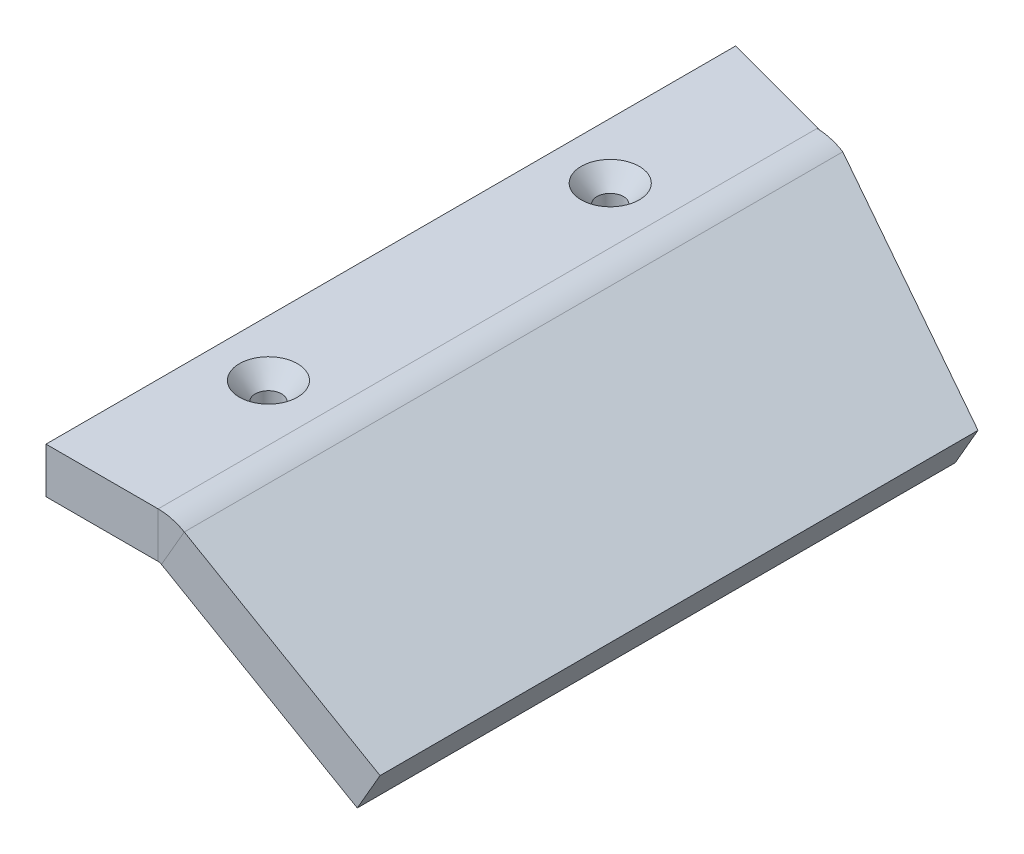
ISO-10303-21;
HEADER;
FILE_DESCRIPTION(('STEP AP214'),'2;1');
FILE_NAME('part.step','',(''),(''),'','','');
FILE_SCHEMA(('AUTOMOTIVE_DESIGN { 1 0 10303 214 1 1 1 1 }'));
ENDSEC;
DATA;
#1=APPLICATION_CONTEXT('core data for automotive mechanical design processes');
#2=APPLICATION_PROTOCOL_DEFINITION('international standard','automotive_design',2000,#1);
#3=PRODUCT_CONTEXT('',#1,'mechanical');
#4=PRODUCT('Part','Part','',(#3));
#5=PRODUCT_RELATED_PRODUCT_CATEGORY('part','',(#4));
#6=PRODUCT_DEFINITION_FORMATION('','',#4);
#7=PRODUCT_DEFINITION_CONTEXT('part definition',#1,'design');
#8=PRODUCT_DEFINITION('design','',#6,#7);
#9=PRODUCT_DEFINITION_SHAPE('','',#8);
#10=(LENGTH_UNIT() NAMED_UNIT(*) SI_UNIT(.MILLI.,.METRE.));
#11=(NAMED_UNIT(*) PLANE_ANGLE_UNIT() SI_UNIT($,.RADIAN.));
#12=(NAMED_UNIT(*) SI_UNIT($,.STERADIAN.) SOLID_ANGLE_UNIT());
#13=UNCERTAINTY_MEASURE_WITH_UNIT(LENGTH_MEASURE(1.E-05),#10,'distance_accuracy_value','');
#14=(GEOMETRIC_REPRESENTATION_CONTEXT(3) GLOBAL_UNCERTAINTY_ASSIGNED_CONTEXT((#13)) GLOBAL_UNIT_ASSIGNED_CONTEXT((#10,
#11,#12)) REPRESENTATION_CONTEXT('',''));
#15=CARTESIAN_POINT('',(0.,0.,0.));
#16=DIRECTION('',(0.,0.,1.));
#17=DIRECTION('',(1.,0.,0.));
#18=AXIS2_PLACEMENT_3D('',#15,#16,#17);
#19=CARTESIAN_POINT('',(0.,-5.08,38.4302));
#20=DIRECTION('',(0.,0.,1.));
#21=DIRECTION('',(1.,0.,0.));
#22=AXIS2_PLACEMENT_3D('',#19,#20,#21);
#23=PLANE('',#22);
#24=DIRECTION('',(1.,0.,0.));
#25=VECTOR('',#24,1.);
#26=CARTESIAN_POINT('',(0.,-5.08,38.4302));
#27=LINE('',#26,#25);
#28=CARTESIAN_POINT('',(0.,-5.08,38.4302));
#29=VERTEX_POINT('',#28);
#30=CARTESIAN_POINT('',(12.5026286248552,-5.08,38.4302));
#31=VERTEX_POINT('',#30);
#32=EDGE_CURVE('E100',#29,#31,#27,.T.);
#33=ORIENTED_EDGE('',*,*,#32,.T.);
#34=DIRECTION('',(0.,1.,0.));
#35=VECTOR('',#34,1.);
#36=CARTESIAN_POINT('',(12.5026286248552,-5.08,38.4302));
#37=LINE('',#36,#35);
#38=CARTESIAN_POINT('',(12.5026286248553,0.,38.4302));
#39=VERTEX_POINT('',#38);
#40=EDGE_CURVE('E222',#31,#39,#37,.T.);
#41=ORIENTED_EDGE('',*,*,#40,.T.);
#42=DIRECTION('',(1.,0.,0.));
#43=VECTOR('',#42,1.);
#44=CARTESIAN_POINT('',(0.,0.,38.4302));
#45=LINE('',#44,#43);
#46=CARTESIAN_POINT('',(0.,0.,38.4302));
#47=VERTEX_POINT('',#46);
#48=EDGE_CURVE('E93',#47,#39,#45,.T.);
#49=ORIENTED_EDGE('',*,*,#48,.F.);
#50=DIRECTION('',(0.,1.,0.));
#51=VECTOR('',#50,1.);
#52=CARTESIAN_POINT('',(0.,-5.08,38.4302));
#53=LINE('',#52,#51);
#54=EDGE_CURVE('E89',#29,#47,#53,.T.);
#55=ORIENTED_EDGE('',*,*,#54,.F.);
#56=EDGE_LOOP('',(#33,#41,#49,#55));
#57=FACE_BOUND('',#56,.T.);
#58=ADVANCED_FACE('F44',(#57),#23,.T.);
#59=CARTESIAN_POINT('',(0.,-5.08,0.));
#60=DIRECTION('',(0.,1.,0.));
#61=DIRECTION('',(0.,0.,1.));
#62=AXIS2_PLACEMENT_3D('',#59,#60,#61);
#63=PLANE('',#62);
#64=CARTESIAN_POINT('',(6.25131431242764,-5.08,-18.2124826891759));
#65=DIRECTION('',(0.,1.,0.));
#66=DIRECTION('',(0.,0.,1.));
#67=AXIS2_PLACEMENT_3D('',#64,#65,#66);
#68=CIRCLE('',#67,1.47319999999999);
#69=CARTESIAN_POINT('',(6.25131431242764,-5.08,-16.739282689176));
#70=VERTEX_POINT('',#69);
#71=EDGE_CURVE('E48',#70,#70,#68,.T.);
#72=ORIENTED_EDGE('',*,*,#71,.T.);
#73=EDGE_LOOP('',(#72));
#74=FACE_BOUND('',#73,.T.);
#75=CARTESIAN_POINT('',(6.25131431242764,-5.08,19.8875173108241));
#76=DIRECTION('',(0.,1.,0.));
#77=DIRECTION('',(0.,0.,1.));
#78=AXIS2_PLACEMENT_3D('',#75,#76,#77);
#79=CIRCLE('',#78,1.47319999999999);
#80=CARTESIAN_POINT('',(6.25131431242764,-5.08,21.360717310824));
#81=VERTEX_POINT('',#80);
#82=EDGE_CURVE('E105',#81,#81,#79,.T.);
#83=ORIENTED_EDGE('',*,*,#82,.T.);
#84=EDGE_LOOP('',(#83));
#85=FACE_BOUND('',#84,.T.);
#86=DIRECTION('',(0.,0.,1.));
#87=VECTOR('',#86,1.);
#88=CARTESIAN_POINT('',(12.5026286248552,-5.08,38.4302));
#89=LINE('',#88,#87);
#90=CARTESIAN_POINT('',(12.5026286248552,-5.08,-35.0272452561247));
#91=VERTEX_POINT('',#90);
#92=EDGE_CURVE('E163',#31,#91,#89,.F.);
#93=ORIENTED_EDGE('',*,*,#92,.F.);
#94=ORIENTED_EDGE('',*,*,#32,.F.);
#95=DIRECTION('',(0.,0.,1.));
#96=VECTOR('',#95,1.);
#97=CARTESIAN_POINT('',(0.,-5.08,-38.4302));
#98=LINE('',#97,#96);
#99=CARTESIAN_POINT('',(0.,-5.08,-38.4302));
#100=VERTEX_POINT('',#99);
#101=EDGE_CURVE('E98',#100,#29,#98,.T.);
#102=ORIENTED_EDGE('',*,*,#101,.F.);
#103=DIRECTION('',(-0.965925826289068,0.,-0.258819045102522));
#104=VECTOR('',#103,1.);
#105=CARTESIAN_POINT('',(0.,-5.08,-38.4302));
#106=LINE('',#105,#104);
#107=CARTESIAN_POINT('',(12.7,-5.08,-35.0272452561247));
#108=VERTEX_POINT('',#107);
#109=EDGE_CURVE('E85',#108,#100,#106,.T.);
#110=ORIENTED_EDGE('',*,*,#109,.F.);
#111=DIRECTION('',(1.,0.,0.));
#112=VECTOR('',#111,1.);
#113=CARTESIAN_POINT('',(12.5026286248552,-5.08,-35.0272452561247));
#114=LINE('',#113,#112);
#115=EDGE_CURVE('E94',#91,#108,#114,.T.);
#116=ORIENTED_EDGE('',*,*,#115,.F.);
#117=EDGE_LOOP('',(#93,#94,#102,#110,#116));
#118=FACE_BOUND('',#117,.T.);
#119=ADVANCED_FACE('F204',(#74,#85,#118),#63,.F.);
#120=CARTESIAN_POINT('',(0.,0.,0.));
#121=DIRECTION('',(0.,1.,0.));
#122=DIRECTION('',(0.,0.,1.));
#123=AXIS2_PLACEMENT_3D('',#120,#121,#122);
#124=PLANE('',#123);
#125=CARTESIAN_POINT('',(6.25131431242764,0.,-18.2124826891759));
#126=DIRECTION('',(0.,1.,0.));
#127=DIRECTION('',(0.,0.,1.));
#128=AXIS2_PLACEMENT_3D('',#125,#126,#127);
#129=CIRCLE('',#128,3.2385);
#130=CARTESIAN_POINT('',(6.25131431242764,0.,-14.9739826891759));
#131=VERTEX_POINT('',#130);
#132=EDGE_CURVE('E387',#131,#131,#129,.T.);
#133=ORIENTED_EDGE('',*,*,#132,.F.);
#134=EDGE_LOOP('',(#133));
#135=FACE_BOUND('',#134,.T.);
#136=CARTESIAN_POINT('',(6.25131431242764,0.,19.8875173108241));
#137=DIRECTION('',(0.,1.,0.));
#138=DIRECTION('',(0.,0.,1.));
#139=AXIS2_PLACEMENT_3D('',#136,#137,#138);
#140=CIRCLE('',#139,3.2385);
#141=CARTESIAN_POINT('',(6.25131431242764,0.,23.1260173108241));
#142=VERTEX_POINT('',#141);
#143=EDGE_CURVE('E115',#142,#142,#140,.T.);
#144=ORIENTED_EDGE('',*,*,#143,.F.);
#145=EDGE_LOOP('',(#144));
#146=FACE_BOUND('',#145,.T.);
#147=ORIENTED_EDGE('',*,*,#48,.T.);
#148=DIRECTION('',(0.,0.,1.));
#149=VECTOR('',#148,1.);
#150=CARTESIAN_POINT('',(12.5026286248553,0.,38.4302));
#151=LINE('',#150,#149);
#152=CARTESIAN_POINT('',(12.5026286248552,0.,-35.0272452561247));
#153=VERTEX_POINT('',#152);
#154=EDGE_CURVE('E159',#39,#153,#151,.F.);
#155=ORIENTED_EDGE('',*,*,#154,.T.);
#156=DIRECTION('',(1.,0.,0.));
#157=VECTOR('',#156,1.);
#158=CARTESIAN_POINT('',(0.,0.,-35.0272452561247));
#159=LINE('',#158,#157);
#160=CARTESIAN_POINT('',(12.7,0.,-35.0272452561247));
#161=VERTEX_POINT('',#160);
#162=EDGE_CURVE('E11',#153,#161,#159,.T.);
#163=ORIENTED_EDGE('',*,*,#162,.T.);
#164=DIRECTION('',(-0.965925826289068,0.,-0.258819045102522));
#165=VECTOR('',#164,1.);
#166=CARTESIAN_POINT('',(0.,0.,-38.4302));
#167=LINE('',#166,#165);
#168=CARTESIAN_POINT('',(0.,0.,-38.4302));
#169=VERTEX_POINT('',#168);
#170=EDGE_CURVE('E83',#161,#169,#167,.T.);
#171=ORIENTED_EDGE('',*,*,#170,.T.);
#172=DIRECTION('',(0.,0.,1.));
#173=VECTOR('',#172,1.);
#174=CARTESIAN_POINT('',(0.,0.,-38.4302));
#175=LINE('',#174,#173);
#176=EDGE_CURVE('E88',#169,#47,#175,.T.);
#177=ORIENTED_EDGE('',*,*,#176,.T.);
#178=EDGE_LOOP('',(#147,#155,#163,#171,#177));
#179=FACE_BOUND('',#178,.T.);
#180=ADVANCED_FACE('F96',(#135,#146,#179),#124,.T.);
#181=CARTESIAN_POINT('',(0.,-5.08,-38.4302));
#182=DIRECTION('',(-1.,0.,0.));
#183=DIRECTION('',(0.,0.,1.));
#184=AXIS2_PLACEMENT_3D('',#181,#182,#183);
#185=PLANE('',#184);
#186=ORIENTED_EDGE('',*,*,#176,.F.);
#187=DIRECTION('',(0.,1.,0.));
#188=VECTOR('',#187,1.);
#189=CARTESIAN_POINT('',(0.,-5.08,-38.4302));
#190=LINE('',#189,#188);
#191=EDGE_CURVE('E54',#100,#169,#190,.T.);
#192=ORIENTED_EDGE('',*,*,#191,.F.);
#193=ORIENTED_EDGE('',*,*,#101,.T.);
#194=ORIENTED_EDGE('',*,*,#54,.T.);
#195=EDGE_LOOP('',(#186,#192,#193,#194));
#196=FACE_BOUND('',#195,.T.);
#197=ADVANCED_FACE('F46',(#196),#185,.T.);
#198=CARTESIAN_POINT('',(0.,-5.08,-38.4302));
#199=DIRECTION('',(0.258819045102521,0.,-0.965925826289068));
#200=DIRECTION('',(-0.965925826289068,0.,-0.258819045102522));
#201=AXIS2_PLACEMENT_3D('',#198,#199,#200);
#202=PLANE('',#201);
#203=ORIENTED_EDGE('',*,*,#170,.F.);
#204=DIRECTION('',(0.,1.,0.));
#205=VECTOR('',#204,1.);
#206=CARTESIAN_POINT('',(12.7,-5.08,-35.0272452561247));
#207=LINE('',#206,#205);
#208=EDGE_CURVE('E77',#108,#161,#207,.T.);
#209=ORIENTED_EDGE('',*,*,#208,.F.);
#210=ORIENTED_EDGE('',*,*,#109,.T.);
#211=ORIENTED_EDGE('',*,*,#191,.T.);
#212=EDGE_LOOP('',(#203,#209,#210,#211));
#213=FACE_BOUND('',#212,.T.);
#214=ADVANCED_FACE('F81',(#213),#202,.T.);
#215=CARTESIAN_POINT('',(12.5026286248552,-5.08,-35.0272452561247));
#216=DIRECTION('',(0.,0.,1.));
#217=DIRECTION('',(0.,-1.,0.));
#218=AXIS2_PLACEMENT_3D('',#215,#216,#217);
#219=PLANE('',#218);
#220=ORIENTED_EDGE('',*,*,#162,.F.);
#221=DIRECTION('',(0.,1.,0.));
#222=VECTOR('',#221,1.);
#223=CARTESIAN_POINT('',(12.5026286248552,-5.08,-35.0272452561247));
#224=LINE('',#223,#222);
#225=EDGE_CURVE('E232',#91,#153,#224,.T.);
#226=ORIENTED_EDGE('',*,*,#225,.F.);
#227=ORIENTED_EDGE('',*,*,#115,.T.);
#228=ORIENTED_EDGE('',*,*,#208,.T.);
#229=EDGE_LOOP('',(#220,#226,#227,#228));
#230=FACE_BOUND('',#229,.T.);
#231=ADVANCED_FACE('F192',(#230),#219,.T.);
#232=CARTESIAN_POINT('',(12.5026286248552,0.0507999999999983,-35.0272452561247));
#233=CARTESIAN_POINT('',(13.5283405845327,0.0508000000000031,-35.0095882202342));
#234=CARTESIAN_POINT('',(14.548036010809,-0.222426565996431,-34.9920167914362));
#235=CARTESIAN_POINT('',(15.4363286248552,-0.735282545835161,-34.9743597555457));
#236=CARTESIAN_POINT('',(12.5026286248552,0.,-35.0272452561247));
#237=CARTESIAN_POINT('',(13.5194599346864,0.,-35.0095882239438));
#238=CARTESIAN_POINT('',(14.5303268791779,-0.270860981431803,-34.9920167877266));
#239=CARTESIAN_POINT('',(15.4109286248552,-0.779276636347411,-34.9743597555457));
#240=CARTESIAN_POINT('',(12.5026286248552,-5.08,-35.0272452561247));
#241=CARTESIAN_POINT('',(12.631394950062,-5.08,-35.0095885948986));
#242=CARTESIAN_POINT('',(12.7594137160742,-5.11430252496899,-34.9920164167718));
#243=CARTESIAN_POINT('',(12.8709286248552,-5.17868568757238,-34.9743597555457));
#244=B_SPLINE_SURFACE_WITH_KNOTS('',1,3,((#232,#233,#234,#235),(#236,#237,#238,#239),(#240,#241,
#242,#243)),.UNSPECIFIED.,.F.,.F.,.F.,(2,1,2),(4,4),(-0.01,0.,1.),(0.,1.),.UNSPECIFIED.);
#245=DIRECTION('',(0.499999999999995,0.866025403784442,0.));
#246=VECTOR('',#245,1.);
#247=CARTESIAN_POINT('',(12.8709286248552,-5.17868568757238,-34.9743597555457));
#248=LINE('',#247,#246);
#249=CARTESIAN_POINT('',(12.8709286248552,-5.17868568757238,-34.9743597555457));
#250=VERTEX_POINT('',#249);
#251=CARTESIAN_POINT('',(15.4109286248552,-0.779276636347418,-34.9743597555457));
#252=VERTEX_POINT('',#251);
#253=EDGE_CURVE('E107',#250,#252,#248,.T.);
#254=CARTESIAN_POINT('',(12.5026286248552,-5.08,-35.0272452561247));
#255=CARTESIAN_POINT('',(12.5106636860023,-5.07999994946432,-35.0261434748627));
#256=CARTESIAN_POINT('',(12.5186987442839,-5.0801314715469,-35.0250416936006));
#257=CARTESIAN_POINT('',(12.5347602582397,-5.08065729818292,-35.0228381310765));
#258=CARTESIAN_POINT('',(12.5427867139139,-5.08105160273637,-35.0217363498144));
#259=CARTESIAN_POINT('',(12.5588224257784,-5.08210263154852,-35.0195327872903));
#260=CARTESIAN_POINT('',(12.5668316819688,-5.08275935580721,-35.0184310060282));
#261=CARTESIAN_POINT('',(12.5828244188752,-5.08433450485931,-35.0162274435041));
#262=CARTESIAN_POINT('',(12.5908078995912,-5.08525292965271,-35.015125662242));
#263=CARTESIAN_POINT('',(12.6067405364979,-5.0873505005714,-35.0129220997179));
#264=CARTESIAN_POINT('',(12.6146896926886,-5.08852964669669,-35.0118203184558));
#265=CARTESIAN_POINT('',(12.6305451684268,-5.09114739647587,-35.0096167559317));
#266=CARTESIAN_POINT('',(12.6384514879742,-5.09258600012976,-35.0085149746697));
#267=CARTESIAN_POINT('',(12.6542128241305,-5.09572112478021,-35.0063114121455));
#268=CARTESIAN_POINT('',(12.6620678407393,-5.09741764577677,-35.0052096308834));
#269=CARTESIAN_POINT('',(12.6777181596734,-5.10106678835187,-35.0030060683593));
#270=CARTESIAN_POINT('',(12.6855134619986,-5.1030194099304,-35.0019042870973));
#271=CARTESIAN_POINT('',(12.7010360049569,-5.10717866278055,-34.9997007245731));
#272=CARTESIAN_POINT('',(12.70876324559,-5.10938529405217,-34.9985989433111));
#273=CARTESIAN_POINT('',(12.7241413906518,-5.11405020334714,-34.9963953807869));
#274=CARTESIAN_POINT('',(12.7317922950805,-5.1165084813705,-34.9952935995249));
#275=CARTESIAN_POINT('',(12.7470095749146,-5.12167405185731,-34.9930900370007));
#276=CARTESIAN_POINT('',(12.7545759503201,-5.12438134432078,-34.9919882557387));
#277=CARTESIAN_POINT('',(12.769616069988,-5.13004204438033,-34.9897846932146));
#278=CARTESIAN_POINT('',(12.7770898142504,-5.13299545197642,-34.9886829119525));
#279=CARTESIAN_POINT('',(12.7919366680203,-5.13914522072795,-34.9864793494284));
#280=CARTESIAN_POINT('',(12.7993097775277,-5.1423415818834,-34.9853775681663));
#281=CARTESIAN_POINT('',(12.8139474684906,-5.14897383124272,-34.9831740056422));
#282=CARTESIAN_POINT('',(12.8212120499463,-5.15240971944659,-34.9820722243801));
#283=CARTESIAN_POINT('',(12.8356248981948,-5.15951735772745,-34.979868661856));
#284=CARTESIAN_POINT('',(12.8427731649878,-5.16318910780444,-34.9787668805939));
#285=CARTESIAN_POINT('',(12.8569457574148,-5.17076448555756,-34.9765633180698));
#286=CARTESIAN_POINT('',(12.8639700830488,-5.17466811323368,-34.9754615368077));
#287=CARTESIAN_POINT('',(12.8709286248552,-5.17868568757238,-34.9743597555457));
#288=B_SPLINE_CURVE_WITH_KNOTS('',3,(#254,#255,#256,#257,#258,#259,#260,#261,#262,#263,#264,
#265,#266,#267,#268,#269,#270,#271,#272,#273,#274,#275,#276,#277,#278,#279,#280,#281,#282,#283,
#284,#285,#286,#287),.UNSPECIFIED.,.F.,.F.,(4,2,2,2,2,2,2,2,2,2,2,2,2,2,2,2,4),(0.,
0.0243296748956679,0.0486593497913393,0.0729890246870078,0.0973186995826769,0.121648374478346,
0.145978049374014,0.170307724269684,0.194637399165352,0.218967074061022,0.24329674895669,
0.267626423852359,0.291956098748027,0.316285773643696,0.340615448539366,0.364945123435034,
0.389274798330704),.UNSPECIFIED.);
#289=EDGE_CURVE('E160',#91,#250,#288,.T.);
#290=CARTESIAN_POINT('',(12.5026286248552,0.,-35.0272452561247));
#291=CARTESIAN_POINT('',(12.5660779008094,3.99057596044768E-07,-35.0261434748627));
#292=CARTESIAN_POINT('',(12.6295271541364,-0.00103817187032179,-35.0250416936006));
#293=CARTESIAN_POINT('',(12.7563577298563,-0.00519038909962282,-35.0228381310765));
#294=CARTESIAN_POINT('',(12.8197390522493,-0.00830403540100605,-35.0217363498144));
#295=CARTESIAN_POINT('',(12.9463658804213,-0.016603538779672,-35.0195327872903));
#296=CARTESIAN_POINT('',(13.0096113862003,-0.0217893958569547,-35.0184310060282));
#297=CARTESIAN_POINT('',(13.1358988603919,-0.0342276418200424,-35.0162274435041));
#298=CARTESIAN_POINT('',(13.1989408288044,-0.0414800307058473,-35.015125662242));
#299=CARTESIAN_POINT('',(13.3247537202403,-0.0580436079603358,-35.0129220997179));
#300=CARTESIAN_POINT('',(13.3875246432636,-0.0673547963290195,-35.0118203184558));
#301=CARTESIAN_POINT('',(13.5127282275407,-0.0880259928611592,-35.0096167559317));
#302=CARTESIAN_POINT('',(13.5751608887944,-0.0993860010246152,-35.0085149746697));
#303=CARTESIAN_POINT('',(13.699621094994,-0.124142674988515,-35.0063114121455));
#304=CARTESIAN_POINT('',(13.7616486399398,-0.137539340788958,-35.0052096308834));
#305=CARTESIAN_POINT('',(13.885232192902,-0.166354983881951,-35.0030060683593));
#306=CARTESIAN_POINT('',(13.9467882009184,-0.181773961174501,-35.0019042870973));
#307=CARTESIAN_POINT('',(14.0693627642787,-0.214617716439495,-34.9997007245731));
#308=CARTESIAN_POINT('',(14.1303813196227,-0.232042494411938,-34.9985989433111));
#309=CARTESIAN_POINT('',(14.2518156375244,-0.26887919194811,-34.9963953807869));
#310=CARTESIAN_POINT('',(14.3122314000821,-0.288291111511837,-34.9952935995249));
#311=CARTESIAN_POINT('',(14.4323954373931,-0.329081306045675,-34.9930900370007));
#312=CARTESIAN_POINT('',(14.4921437121464,-0.350459581015785,-34.9919882557387));
#313=CARTESIAN_POINT('',(14.6109087950413,-0.395159591830866,-34.9897846932146));
#314=CARTESIAN_POINT('',(14.6699256031828,-0.418481327675838,-34.9886829119525));
#315=CARTESIAN_POINT('',(14.7871645519171,-0.467043294713831,-34.9864793494284));
#316=CARTESIAN_POINT('',(14.8453866925098,-0.492283525906853,-34.9853775681663));
#317=CARTESIAN_POINT('',(14.9609739763211,-0.54465542602009,-34.9831740056422));
#318=CARTESIAN_POINT('',(15.0183391195396,-0.571787094940304,-34.9820722243801));
#319=CARTESIAN_POINT('',(15.1321509212265,-0.627912928261587,-34.979868661856));
#320=CARTESIAN_POINT('',(15.1885975796949,-0.656907092662655,-34.9787668805939));
#321=CARTESIAN_POINT('',(15.3005121888597,-0.716726454920019,-34.9765633180698));
#322=CARTESIAN_POINT('',(15.355980139556,-0.747551652776314,-34.9754615368077));
#323=CARTESIAN_POINT('',(15.4109286248552,-0.77927663634741,-34.9743597555457));
#324=B_SPLINE_CURVE_WITH_KNOTS('',3,(#290,#291,#292,#293,#294,#295,#296,#297,#298,#299,#300,
#301,#302,#303,#304,#305,#306,#307,#308,#309,#310,#311,#312,#313,#314,#315,#316,#317,#318,#319,
#320,#321,#322,#323),.UNSPECIFIED.,.F.,.F.,(4,2,2,2,2,2,2,2,2,2,2,2,2,2,2,2,4),(0.,
0.190367993726139,0.380735987452281,0.571103981178422,0.761471974904561,0.951839968630701,
1.14220796235684,1.33257595608298,1.52294394980912,1.71331194353526,1.90367993726141,
2.09404793098755,2.28441592471369,2.47478391843983,2.66515191216597,2.85551990589211,
3.04588789961825),.UNSPECIFIED.);
#325=EDGE_CURVE('E235',#153,#252,#324,.T.);
#326=ORIENTED_EDGE('',*,*,#253,.F.);
#327=ORIENTED_EDGE('',*,*,#289,.F.);
#328=ORIENTED_EDGE('',*,*,#225,.T.);
#329=ORIENTED_EDGE('',*,*,#325,.T.);
#330=EDGE_LOOP('',(#326,#327,#328,#329));
#331=FACE_BOUND('',#330,.T.);
#332=ADVANCED_FACE('F186',(#331),#244,.F.);
#333=CARTESIAN_POINT('',(12.5026286248552,-5.8166,38.4302));
#334=DIRECTION('',(0.,0.,-1.));
#335=DIRECTION('',(-1.,0.,0.));
#336=AXIS2_PLACEMENT_3D('',#333,#334,#335);
#337=PLANE('',#336);
#338=CARTESIAN_POINT('',(12.5026286248552,-5.8166,38.4302));
#339=DIRECTION('',(0.,0.,1.));
#340=DIRECTION('',(1.,0.,0.));
#341=AXIS2_PLACEMENT_3D('',#338,#339,#340);
#342=CIRCLE('',#341,0.736600000000001);
#343=CARTESIAN_POINT('',(12.8709286248552,-5.17868568757238,38.4302));
#344=VERTEX_POINT('',#343);
#345=EDGE_CURVE('E153',#344,#31,#342,.T.);
#346=ORIENTED_EDGE('',*,*,#345,.F.);
#347=DIRECTION('',(0.499999999999995,0.866025403784442,0.));
#348=VECTOR('',#347,1.);
#349=CARTESIAN_POINT('',(12.8709286248552,-5.17868568757238,38.4302));
#350=LINE('',#349,#348);
#351=CARTESIAN_POINT('',(15.4109286248552,-0.779276636347415,38.4302));
#352=VERTEX_POINT('',#351);
#353=EDGE_CURVE('E125',#344,#352,#350,.T.);
#354=ORIENTED_EDGE('',*,*,#353,.T.);
#355=CARTESIAN_POINT('',(12.5026286248552,-5.8166,38.4302));
#356=DIRECTION('',(0.,0.,1.));
#357=DIRECTION('',(1.,0.,0.));
#358=AXIS2_PLACEMENT_3D('',#355,#356,#357);
#359=CIRCLE('',#358,5.8166);
#360=EDGE_CURVE('E156',#352,#39,#359,.T.);
#361=ORIENTED_EDGE('',*,*,#360,.T.);
#362=ORIENTED_EDGE('',*,*,#40,.F.);
#363=EDGE_LOOP('',(#346,#354,#361,#362));
#364=FACE_BOUND('',#363,.T.);
#365=ADVANCED_FACE('F191',(#364),#337,.F.);
#366=CARTESIAN_POINT('',(12.5026286248552,-5.8166,38.4302));
#367=DIRECTION('',(0.,0.,1.));
#368=DIRECTION('',(0.499999999999995,0.866025403784441,0.));
#369=AXIS2_PLACEMENT_3D('',#366,#367,#368);
#370=CYLINDRICAL_SURFACE('',#369,5.8166);
#371=ORIENTED_EDGE('',*,*,#154,.F.);
#372=ORIENTED_EDGE('',*,*,#360,.F.);
#373=DIRECTION('',(0.,0.,1.));
#374=VECTOR('',#373,1.);
#375=CARTESIAN_POINT('',(15.4109286248552,-0.779276636347416,0.));
#376=LINE('',#375,#374);
#377=EDGE_CURVE('E127',#252,#352,#376,.T.);
#378=ORIENTED_EDGE('',*,*,#377,.F.);
#379=ORIENTED_EDGE('',*,*,#325,.F.);
#380=EDGE_LOOP('',(#371,#372,#378,#379));
#381=FACE_BOUND('',#380,.T.);
#382=ADVANCED_FACE('F182',(#381),#370,.T.);
#383=CARTESIAN_POINT('',(12.5026286248552,-5.8166,38.4302));
#384=DIRECTION('',(0.,0.,1.));
#385=DIRECTION('',(0.499999999999995,0.866025403784441,0.));
#386=AXIS2_PLACEMENT_3D('',#383,#384,#385);
#387=CYLINDRICAL_SURFACE('',#386,0.736600000000001);
#388=ORIENTED_EDGE('',*,*,#92,.T.);
#389=ORIENTED_EDGE('',*,*,#289,.T.);
#390=DIRECTION('',(0.,0.,1.));
#391=VECTOR('',#390,1.);
#392=CARTESIAN_POINT('',(12.8709286248552,-5.17868568757238,-34.9743597555457));
#393=LINE('',#392,#391);
#394=EDGE_CURVE('E112',#250,#344,#393,.T.);
#395=ORIENTED_EDGE('',*,*,#394,.T.);
#396=ORIENTED_EDGE('',*,*,#345,.T.);
#397=EDGE_LOOP('',(#388,#389,#395,#396));
#398=FACE_BOUND('',#397,.T.);
#399=ADVANCED_FACE('F171',(#398),#387,.F.);
#400=CARTESIAN_POINT('',(15.24,-0.680590948775038,38.4302));
#401=DIRECTION('',(0.,0.,1.));
#402=DIRECTION('',(0.,-1.,0.));
#403=AXIS2_PLACEMENT_3D('',#400,#401,#402);
#404=PLANE('',#403);
#405=DIRECTION('',(-0.866025403784441,0.499999999999995,0.));
#406=VECTOR('',#405,1.);
#407=CARTESIAN_POINT('',(15.24,-0.680590948775038,38.4302));
#408=LINE('',#407,#406);
#409=CARTESIAN_POINT('',(37.2370452561248,-13.3805909487749,38.4302));
#410=VERTEX_POINT('',#409);
#411=EDGE_CURVE('E139',#410,#352,#408,.T.);
#412=ORIENTED_EDGE('',*,*,#411,.T.);
#413=ORIENTED_EDGE('',*,*,#353,.F.);
#414=DIRECTION('',(-0.866025403784441,0.499999999999995,0.));
#415=VECTOR('',#414,1.);
#416=CARTESIAN_POINT('',(12.7,-5.08,38.4302));
#417=LINE('',#416,#415);
#418=CARTESIAN_POINT('',(34.6970452561248,-17.7799999999999,38.4302));
#419=VERTEX_POINT('',#418);
#420=EDGE_CURVE('E136',#419,#344,#417,.T.);
#421=ORIENTED_EDGE('',*,*,#420,.F.);
#422=DIRECTION('',(-0.499999999999995,-0.866025403784441,0.));
#423=VECTOR('',#422,1.);
#424=CARTESIAN_POINT('',(37.2370452561248,-13.3805909487749,38.4302));
#425=LINE('',#424,#423);
#426=EDGE_CURVE('E150',#410,#419,#425,.T.);
#427=ORIENTED_EDGE('',*,*,#426,.F.);
#428=EDGE_LOOP('',(#412,#413,#421,#427));
#429=FACE_BOUND('',#428,.T.);
#430=ADVANCED_FACE('F181',(#429),#404,.T.);
#431=CARTESIAN_POINT('',(15.24,-0.680590948775038,-35.0272452561247));
#432=DIRECTION('',(0.224143868042015,-0.129409522551259,-0.965925826289068));
#433=DIRECTION('',(-0.974116947696297,0.,-0.226044624379457));
#434=AXIS2_PLACEMENT_3D('',#431,#432,#433);
#435=PLANE('',#434);
#436=DIRECTION('',(0.836516303737811,-0.482962913144529,0.258819045102521));
#437=VECTOR('',#436,1.);
#438=CARTESIAN_POINT('',(12.7,-5.08,-35.0272452561247));
#439=LINE('',#438,#437);
#440=CARTESIAN_POINT('',(34.6970452561248,-17.7799999999999,-28.2213357683742));
#441=VERTEX_POINT('',#440);
#442=EDGE_CURVE('E131',#250,#441,#439,.T.);
#443=ORIENTED_EDGE('',*,*,#442,.F.);
#444=ORIENTED_EDGE('',*,*,#253,.T.);
#445=DIRECTION('',(0.836516303737811,-0.482962913144529,0.258819045102521));
#446=VECTOR('',#445,1.);
#447=CARTESIAN_POINT('',(15.24,-0.680590948775038,-35.0272452561247));
#448=LINE('',#447,#446);
#449=CARTESIAN_POINT('',(37.2370452561248,-13.3805909487749,-28.2213357683742));
#450=VERTEX_POINT('',#449);
#451=EDGE_CURVE('E132',#252,#450,#448,.T.);
#452=ORIENTED_EDGE('',*,*,#451,.T.);
#453=DIRECTION('',(-0.499999999999995,-0.866025403784441,0.));
#454=VECTOR('',#453,1.);
#455=CARTESIAN_POINT('',(37.2370452561248,-13.3805909487749,-28.2213357683742));
#456=LINE('',#455,#454);
#457=EDGE_CURVE('E142',#450,#441,#456,.T.);
#458=ORIENTED_EDGE('',*,*,#457,.T.);
#459=EDGE_LOOP('',(#443,#444,#452,#458));
#460=FACE_BOUND('',#459,.T.);
#461=ADVANCED_FACE('F288',(#460),#435,.T.);
#462=CARTESIAN_POINT('',(3.51529547438745,6.08867036525609,0.));
#463=DIRECTION('',(0.499999999999995,0.866025403784442,0.));
#464=DIRECTION('',(-0.866025403784441,0.499999999999995,0.));
#465=AXIS2_PLACEMENT_3D('',#462,#463,#464);
#466=PLANE('',#465);
#467=ORIENTED_EDGE('',*,*,#451,.F.);
#468=ORIENTED_EDGE('',*,*,#377,.T.);
#469=ORIENTED_EDGE('',*,*,#411,.F.);
#470=DIRECTION('',(0.,0.,1.));
#471=VECTOR('',#470,1.);
#472=CARTESIAN_POINT('',(37.2370452561248,-13.3805909487749,38.4302));
#473=LINE('',#472,#471);
#474=EDGE_CURVE('E135',#450,#410,#473,.T.);
#475=ORIENTED_EDGE('',*,*,#474,.F.);
#476=EDGE_LOOP('',(#467,#468,#469,#475));
#477=FACE_BOUND('',#476,.T.);
#478=ADVANCED_FACE('F263',(#477),#466,.T.);
#479=CARTESIAN_POINT('',(0.975295474387477,1.68926131403112,0.));
#480=DIRECTION('',(0.499999999999995,0.866025403784442,0.));
#481=DIRECTION('',(-0.866025403784441,0.499999999999995,0.));
#482=AXIS2_PLACEMENT_3D('',#479,#480,#481);
#483=PLANE('',#482);
#484=ORIENTED_EDGE('',*,*,#394,.F.);
#485=ORIENTED_EDGE('',*,*,#442,.T.);
#486=DIRECTION('',(0.,0.,1.));
#487=VECTOR('',#486,1.);
#488=CARTESIAN_POINT('',(34.6970452561248,-17.7799999999999,38.4302));
#489=LINE('',#488,#487);
#490=EDGE_CURVE('E145',#441,#419,#489,.T.);
#491=ORIENTED_EDGE('',*,*,#490,.T.);
#492=ORIENTED_EDGE('',*,*,#420,.T.);
#493=EDGE_LOOP('',(#484,#485,#491,#492));
#494=FACE_BOUND('',#493,.T.);
#495=ADVANCED_FACE('F290',(#494),#483,.F.);
#496=CARTESIAN_POINT('',(37.2370452561248,-13.3805909487749,38.4302));
#497=DIRECTION('',(0.866025403784441,-0.499999999999995,0.));
#498=DIRECTION('',(0.499999999999995,0.866025403784442,0.));
#499=AXIS2_PLACEMENT_3D('',#496,#497,#498);
#500=PLANE('',#499);
#501=ORIENTED_EDGE('',*,*,#490,.F.);
#502=ORIENTED_EDGE('',*,*,#457,.F.);
#503=ORIENTED_EDGE('',*,*,#474,.T.);
#504=ORIENTED_EDGE('',*,*,#426,.T.);
#505=EDGE_LOOP('',(#501,#502,#503,#504));
#506=FACE_BOUND('',#505,.T.);
#507=ADVANCED_FACE('F272',(#506),#500,.T.);
#508=CARTESIAN_POINT('',(6.25131431242764,0.,19.8875173108241));
#509=DIRECTION('',(0.,1.,0.));
#510=DIRECTION('',(0.,0.,1.));
#511=AXIS2_PLACEMENT_3D('',#508,#509,#510);
#512=CYLINDRICAL_SURFACE('',#511,1.47319999999999);
#513=CARTESIAN_POINT('',(6.25131431242764,-2.03074534926725,19.8875173108241));
#514=DIRECTION('',(0.,1.,0.));
#515=DIRECTION('',(0.,0.,1.));
#516=AXIS2_PLACEMENT_3D('',#513,#514,#515);
#517=CIRCLE('',#516,1.47319999999999);
#518=CARTESIAN_POINT('',(6.25131431242764,-2.03074534926725,21.360717310824));
#519=VERTEX_POINT('',#518);
#520=EDGE_CURVE('E108',#519,#519,#517,.T.);
#521=ORIENTED_EDGE('',*,*,#520,.T.);
#522=EDGE_LOOP('',(#521));
#523=FACE_BOUND('',#522,.T.);
#524=ORIENTED_EDGE('',*,*,#82,.F.);
#525=EDGE_LOOP('',(#524));
#526=FACE_BOUND('',#525,.T.);
#527=ADVANCED_FACE('F297',(#523,#526),#512,.F.);
#528=CARTESIAN_POINT('',(6.25131431242764,0.,19.8875173108241));
#529=DIRECTION('',(0.,1.,0.));
#530=DIRECTION('',(0.,0.,1.));
#531=AXIS2_PLACEMENT_3D('',#528,#529,#530);
#532=CONICAL_SURFACE('',#531,3.2385,0.715584993317677);
#533=ORIENTED_EDGE('',*,*,#520,.F.);
#534=EDGE_LOOP('',(#533));
#535=FACE_BOUND('',#534,.T.);
#536=ORIENTED_EDGE('',*,*,#143,.T.);
#537=EDGE_LOOP('',(#536));
#538=FACE_BOUND('',#537,.T.);
#539=ADVANCED_FACE('F349',(#535,#538),#532,.F.);
#540=CARTESIAN_POINT('',(6.25131431242764,0.,-18.2124826891759));
#541=DIRECTION('',(0.,1.,0.));
#542=DIRECTION('',(0.,0.,1.));
#543=AXIS2_PLACEMENT_3D('',#540,#541,#542);
#544=CYLINDRICAL_SURFACE('',#543,1.47319999999999);
#545=CARTESIAN_POINT('',(6.25131431242764,-2.03074534926725,-18.2124826891759));
#546=DIRECTION('',(0.,1.,0.));
#547=DIRECTION('',(0.,0.,1.));
#548=AXIS2_PLACEMENT_3D('',#545,#546,#547);
#549=CIRCLE('',#548,1.47319999999999);
#550=CARTESIAN_POINT('',(6.25131431242764,-2.03074534926725,-16.739282689176));
#551=VERTEX_POINT('',#550);
#552=EDGE_CURVE('E384',#551,#551,#549,.T.);
#553=ORIENTED_EDGE('',*,*,#552,.T.);
#554=EDGE_LOOP('',(#553));
#555=FACE_BOUND('',#554,.T.);
#556=ORIENTED_EDGE('',*,*,#71,.F.);
#557=EDGE_LOOP('',(#556));
#558=FACE_BOUND('',#557,.T.);
#559=ADVANCED_FACE('F357',(#555,#558),#544,.F.);
#560=CARTESIAN_POINT('',(6.25131431242764,0.,-18.2124826891759));
#561=DIRECTION('',(0.,1.,0.));
#562=DIRECTION('',(0.,0.,1.));
#563=AXIS2_PLACEMENT_3D('',#560,#561,#562);
#564=CONICAL_SURFACE('',#563,3.2385,0.715584993317677);
#565=ORIENTED_EDGE('',*,*,#552,.F.);
#566=EDGE_LOOP('',(#565));
#567=FACE_BOUND('',#566,.T.);
#568=ORIENTED_EDGE('',*,*,#132,.T.);
#569=EDGE_LOOP('',(#568));
#570=FACE_BOUND('',#569,.T.);
#571=ADVANCED_FACE('F367',(#567,#570),#564,.F.);
#572=CLOSED_SHELL('',(#58,#119,#180,#197,#214,#231,#332,#365,#382,#399,#430,#461,#478,#495,#507,
#527,#539,#559,#571));
#573=MANIFOLD_SOLID_BREP('B2',#572);
#574=ADVANCED_BREP_SHAPE_REPRESENTATION('',(#18,#573),#14);
#575=SHAPE_DEFINITION_REPRESENTATION(#9,#574);
ENDSEC;
END-ISO-10303-21;
